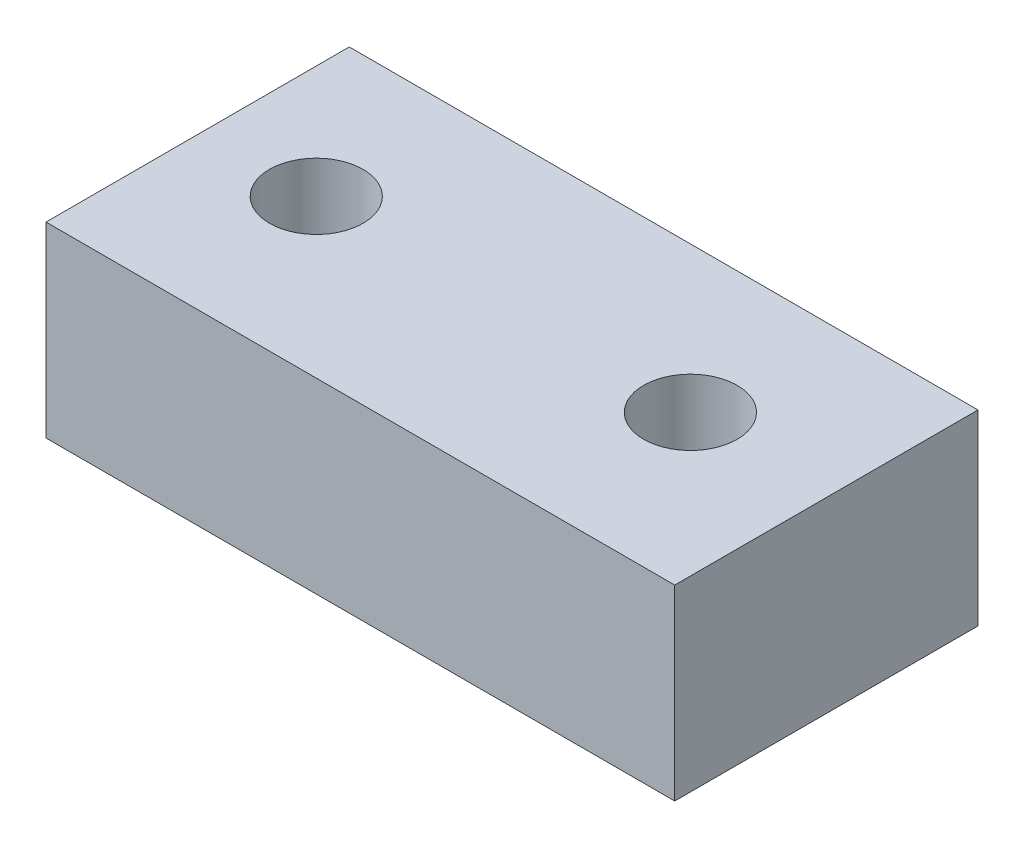
ISO-10303-21;
HEADER;
FILE_DESCRIPTION(('STEP AP214'),'2;1');
FILE_NAME('part.step','',(''),(''),'','','');
FILE_SCHEMA(('AUTOMOTIVE_DESIGN { 1 0 10303 214 1 1 1 1 }'));
ENDSEC;
DATA;
#1=APPLICATION_CONTEXT('core data for automotive mechanical design processes');
#2=APPLICATION_PROTOCOL_DEFINITION('international standard','automotive_design',2000,#1);
#3=PRODUCT_CONTEXT('',#1,'mechanical');
#4=PRODUCT('Part','Part','',(#3));
#5=PRODUCT_RELATED_PRODUCT_CATEGORY('part','',(#4));
#6=PRODUCT_DEFINITION_FORMATION('','',#4);
#7=PRODUCT_DEFINITION_CONTEXT('part definition',#1,'design');
#8=PRODUCT_DEFINITION('design','',#6,#7);
#9=PRODUCT_DEFINITION_SHAPE('','',#8);
#10=(LENGTH_UNIT() NAMED_UNIT(*) SI_UNIT(.MILLI.,.METRE.));
#11=(NAMED_UNIT(*) PLANE_ANGLE_UNIT() SI_UNIT($,.RADIAN.));
#12=(NAMED_UNIT(*) SI_UNIT($,.STERADIAN.) SOLID_ANGLE_UNIT());
#13=UNCERTAINTY_MEASURE_WITH_UNIT(LENGTH_MEASURE(1.E-05),#10,'distance_accuracy_value','');
#14=(GEOMETRIC_REPRESENTATION_CONTEXT(3) GLOBAL_UNCERTAINTY_ASSIGNED_CONTEXT((#13)) GLOBAL_UNIT_ASSIGNED_CONTEXT((#10,
#11,#12)) REPRESENTATION_CONTEXT('',''));
#15=CARTESIAN_POINT('',(0.,0.,0.));
#16=DIRECTION('',(0.,0.,1.));
#17=DIRECTION('',(1.,0.,0.));
#18=AXIS2_PLACEMENT_3D('',#15,#16,#17);
#19=CARTESIAN_POINT('',(7.03043426710078,4.,0.));
#20=DIRECTION('',(1.,0.,0.));
#21=DIRECTION('',(0.,0.,-1.));
#22=AXIS2_PLACEMENT_3D('',#19,#20,#21);
#23=PLANE('',#22);
#24=DIRECTION('',(0.,0.,1.));
#25=VECTOR('',#24,1.);
#26=CARTESIAN_POINT('',(7.03043426710078,0.,0.));
#27=LINE('',#26,#25);
#28=CARTESIAN_POINT('',(7.03043426710078,0.,-3.11893873197504));
#29=VERTEX_POINT('',#28);
#30=CARTESIAN_POINT('',(7.03043426710078,0.,3.36592111816746));
#31=VERTEX_POINT('',#30);
#32=EDGE_CURVE('E127',#29,#31,#27,.T.);
#33=ORIENTED_EDGE('',*,*,#32,.F.);
#34=DIRECTION('',(0.,-1.,0.));
#35=VECTOR('',#34,1.);
#36=CARTESIAN_POINT('',(7.03043426710078,4.,-3.11893873197504));
#37=LINE('',#36,#35);
#38=CARTESIAN_POINT('',(7.03043426710078,4.,-3.11893873197504));
#39=VERTEX_POINT('',#38);
#40=EDGE_CURVE('E11',#39,#29,#37,.T.);
#41=ORIENTED_EDGE('',*,*,#40,.F.);
#42=DIRECTION('',(0.,0.,1.));
#43=VECTOR('',#42,1.);
#44=CARTESIAN_POINT('',(7.03043426710078,4.,0.));
#45=LINE('',#44,#43);
#46=CARTESIAN_POINT('',(7.03043426710078,4.,3.36592111816746));
#47=VERTEX_POINT('',#46);
#48=EDGE_CURVE('E109',#39,#47,#45,.T.);
#49=ORIENTED_EDGE('',*,*,#48,.T.);
#50=DIRECTION('',(0.,-1.,0.));
#51=VECTOR('',#50,1.);
#52=CARTESIAN_POINT('',(7.03043426710078,4.,3.36592111816746));
#53=LINE('',#52,#51);
#54=EDGE_CURVE('E86',#47,#31,#53,.T.);
#55=ORIENTED_EDGE('',*,*,#54,.T.);
#56=EDGE_LOOP('',(#33,#41,#49,#55));
#57=FACE_BOUND('',#56,.T.);
#58=ADVANCED_FACE('F45',(#57),#23,.T.);
#59=CARTESIAN_POINT('',(0.,4.,-3.11893873197504));
#60=DIRECTION('',(0.,0.,-1.));
#61=DIRECTION('',(-1.,0.,0.));
#62=AXIS2_PLACEMENT_3D('',#59,#60,#61);
#63=PLANE('',#62);
#64=DIRECTION('',(1.,0.,0.));
#65=VECTOR('',#64,1.);
#66=CARTESIAN_POINT('',(0.,0.,-3.11893873197504));
#67=LINE('',#66,#65);
#68=CARTESIAN_POINT('',(-6.41308105357813,0.,-3.11893873197504));
#69=VERTEX_POINT('',#68);
#70=EDGE_CURVE('E98',#69,#29,#67,.T.);
#71=ORIENTED_EDGE('',*,*,#70,.F.);
#72=DIRECTION('',(0.,-1.,0.));
#73=VECTOR('',#72,1.);
#74=CARTESIAN_POINT('',(-6.41308105357813,4.,-3.11893873197504));
#75=LINE('',#74,#73);
#76=CARTESIAN_POINT('',(-6.41308105357813,4.,-3.11893873197504));
#77=VERTEX_POINT('',#76);
#78=EDGE_CURVE('E55',#77,#69,#75,.T.);
#79=ORIENTED_EDGE('',*,*,#78,.F.);
#80=DIRECTION('',(1.,0.,0.));
#81=VECTOR('',#80,1.);
#82=CARTESIAN_POINT('',(0.,4.,-3.11893873197504));
#83=LINE('',#82,#81);
#84=EDGE_CURVE('E96',#77,#39,#83,.T.);
#85=ORIENTED_EDGE('',*,*,#84,.T.);
#86=ORIENTED_EDGE('',*,*,#40,.T.);
#87=EDGE_LOOP('',(#71,#79,#85,#86));
#88=FACE_BOUND('',#87,.T.);
#89=ADVANCED_FACE('F94',(#88),#63,.T.);
#90=CARTESIAN_POINT('',(-6.41308105357813,4.,0.));
#91=DIRECTION('',(1.,0.,0.));
#92=DIRECTION('',(0.,0.,-1.));
#93=AXIS2_PLACEMENT_3D('',#90,#91,#92);
#94=PLANE('',#93);
#95=DIRECTION('',(0.,0.,1.));
#96=VECTOR('',#95,1.);
#97=CARTESIAN_POINT('',(-6.41308105357813,0.,0.));
#98=LINE('',#97,#96);
#99=CARTESIAN_POINT('',(-6.41308105357813,0.,3.36592111816746));
#100=VERTEX_POINT('',#99);
#101=EDGE_CURVE('E132',#69,#100,#98,.T.);
#102=ORIENTED_EDGE('',*,*,#101,.T.);
#103=DIRECTION('',(0.,-1.,0.));
#104=VECTOR('',#103,1.);
#105=CARTESIAN_POINT('',(-6.41308105357813,4.,3.36592111816746));
#106=LINE('',#105,#104);
#107=CARTESIAN_POINT('',(-6.41308105357813,4.,3.36592111816746));
#108=VERTEX_POINT('',#107);
#109=EDGE_CURVE('E102',#108,#100,#106,.T.);
#110=ORIENTED_EDGE('',*,*,#109,.F.);
#111=DIRECTION('',(0.,0.,1.));
#112=VECTOR('',#111,1.);
#113=CARTESIAN_POINT('',(-6.41308105357813,4.,0.));
#114=LINE('',#113,#112);
#115=EDGE_CURVE('E104',#77,#108,#114,.T.);
#116=ORIENTED_EDGE('',*,*,#115,.F.);
#117=ORIENTED_EDGE('',*,*,#78,.T.);
#118=EDGE_LOOP('',(#102,#110,#116,#117));
#119=FACE_BOUND('',#118,.T.);
#120=ADVANCED_FACE('F105',(#119),#94,.F.);
#121=CARTESIAN_POINT('',(-4.,4.,0.));
#122=DIRECTION('',(0.,-1.,0.));
#123=DIRECTION('',(0.,0.,-1.));
#124=AXIS2_PLACEMENT_3D('',#121,#122,#123);
#125=CYLINDRICAL_SURFACE('',#124,1.);
#126=CARTESIAN_POINT('',(-4.,4.,0.));
#127=DIRECTION('',(0.,1.,0.));
#128=DIRECTION('',(0.,0.,1.));
#129=AXIS2_PLACEMENT_3D('',#126,#127,#128);
#130=CIRCLE('',#129,1.);
#131=CARTESIAN_POINT('',(-4.,4.,1.));
#132=VERTEX_POINT('',#131);
#133=EDGE_CURVE('E113',#132,#132,#130,.T.);
#134=ORIENTED_EDGE('',*,*,#133,.T.);
#135=EDGE_LOOP('',(#134));
#136=FACE_BOUND('',#135,.T.);
#137=CARTESIAN_POINT('',(-4.,0.,0.));
#138=DIRECTION('',(0.,1.,0.));
#139=DIRECTION('',(0.,0.,1.));
#140=AXIS2_PLACEMENT_3D('',#137,#138,#139);
#141=CIRCLE('',#140,1.);
#142=CARTESIAN_POINT('',(-4.,0.,1.));
#143=VERTEX_POINT('',#142);
#144=EDGE_CURVE('E123',#143,#143,#141,.T.);
#145=ORIENTED_EDGE('',*,*,#144,.F.);
#146=EDGE_LOOP('',(#145));
#147=FACE_BOUND('',#146,.T.);
#148=ADVANCED_FACE('F151',(#136,#147),#125,.F.);
#149=CARTESIAN_POINT('',(4.,4.,0.));
#150=DIRECTION('',(0.,-1.,0.));
#151=DIRECTION('',(0.,0.,-1.));
#152=AXIS2_PLACEMENT_3D('',#149,#150,#151);
#153=CYLINDRICAL_SURFACE('',#152,1.);
#154=CARTESIAN_POINT('',(4.,4.,0.));
#155=DIRECTION('',(0.,1.,0.));
#156=DIRECTION('',(0.,0.,1.));
#157=AXIS2_PLACEMENT_3D('',#154,#155,#156);
#158=CIRCLE('',#157,1.);
#159=CARTESIAN_POINT('',(4.,4.,1.));
#160=VERTEX_POINT('',#159);
#161=EDGE_CURVE('E137',#160,#160,#158,.T.);
#162=ORIENTED_EDGE('',*,*,#161,.T.);
#163=EDGE_LOOP('',(#162));
#164=FACE_BOUND('',#163,.T.);
#165=CARTESIAN_POINT('',(4.,0.,0.));
#166=DIRECTION('',(0.,1.,0.));
#167=DIRECTION('',(0.,0.,1.));
#168=AXIS2_PLACEMENT_3D('',#165,#166,#167);
#169=CIRCLE('',#168,1.);
#170=CARTESIAN_POINT('',(4.,0.,1.));
#171=VERTEX_POINT('',#170);
#172=EDGE_CURVE('E119',#171,#171,#169,.T.);
#173=ORIENTED_EDGE('',*,*,#172,.F.);
#174=EDGE_LOOP('',(#173));
#175=FACE_BOUND('',#174,.T.);
#176=ADVANCED_FACE('F47',(#164,#175),#153,.F.);
#177=CARTESIAN_POINT('',(0.,4.,3.36592111816746));
#178=DIRECTION('',(0.,0.,-1.));
#179=DIRECTION('',(-1.,0.,0.));
#180=AXIS2_PLACEMENT_3D('',#177,#178,#179);
#181=PLANE('',#180);
#182=DIRECTION('',(1.,0.,0.));
#183=VECTOR('',#182,1.);
#184=CARTESIAN_POINT('',(0.,0.,3.36592111816746));
#185=LINE('',#184,#183);
#186=EDGE_CURVE('E79',#100,#31,#185,.T.);
#187=ORIENTED_EDGE('',*,*,#186,.T.);
#188=ORIENTED_EDGE('',*,*,#54,.F.);
#189=DIRECTION('',(1.,0.,0.));
#190=VECTOR('',#189,1.);
#191=CARTESIAN_POINT('',(0.,4.,3.36592111816746));
#192=LINE('',#191,#190);
#193=EDGE_CURVE('E63',#108,#47,#192,.T.);
#194=ORIENTED_EDGE('',*,*,#193,.F.);
#195=ORIENTED_EDGE('',*,*,#109,.T.);
#196=EDGE_LOOP('',(#187,#188,#194,#195));
#197=FACE_BOUND('',#196,.T.);
#198=ADVANCED_FACE('F142',(#197),#181,.F.);
#199=CARTESIAN_POINT('',(0.,4.,0.));
#200=DIRECTION('',(0.,1.,0.));
#201=DIRECTION('',(0.,0.,1.));
#202=AXIS2_PLACEMENT_3D('',#199,#200,#201);
#203=PLANE('',#202);
#204=ORIENTED_EDGE('',*,*,#161,.F.);
#205=EDGE_LOOP('',(#204));
#206=FACE_BOUND('',#205,.T.);
#207=ORIENTED_EDGE('',*,*,#133,.F.);
#208=EDGE_LOOP('',(#207));
#209=FACE_BOUND('',#208,.T.);
#210=ORIENTED_EDGE('',*,*,#48,.F.);
#211=ORIENTED_EDGE('',*,*,#84,.F.);
#212=ORIENTED_EDGE('',*,*,#115,.T.);
#213=ORIENTED_EDGE('',*,*,#193,.T.);
#214=EDGE_LOOP('',(#210,#211,#212,#213));
#215=FACE_BOUND('',#214,.T.);
#216=ADVANCED_FACE('F108',(#206,#209,#215),#203,.T.);
#217=CARTESIAN_POINT('',(0.,0.,0.));
#218=DIRECTION('',(0.,1.,0.));
#219=DIRECTION('',(0.,0.,1.));
#220=AXIS2_PLACEMENT_3D('',#217,#218,#219);
#221=PLANE('',#220);
#222=ORIENTED_EDGE('',*,*,#172,.T.);
#223=EDGE_LOOP('',(#222));
#224=FACE_BOUND('',#223,.T.);
#225=ORIENTED_EDGE('',*,*,#144,.T.);
#226=EDGE_LOOP('',(#225));
#227=FACE_BOUND('',#226,.T.);
#228=ORIENTED_EDGE('',*,*,#32,.T.);
#229=ORIENTED_EDGE('',*,*,#186,.F.);
#230=ORIENTED_EDGE('',*,*,#101,.F.);
#231=ORIENTED_EDGE('',*,*,#70,.T.);
#232=EDGE_LOOP('',(#228,#229,#230,#231));
#233=FACE_BOUND('',#232,.T.);
#234=ADVANCED_FACE('F143',(#224,#227,#233),#221,.F.);
#235=CLOSED_SHELL('',(#58,#89,#120,#148,#176,#198,#216,#234));
#236=MANIFOLD_SOLID_BREP('B2',#235);
#237=ADVANCED_BREP_SHAPE_REPRESENTATION('',(#18,#236),#14);
#238=SHAPE_DEFINITION_REPRESENTATION(#9,#237);
ENDSEC;
END-ISO-10303-21;
